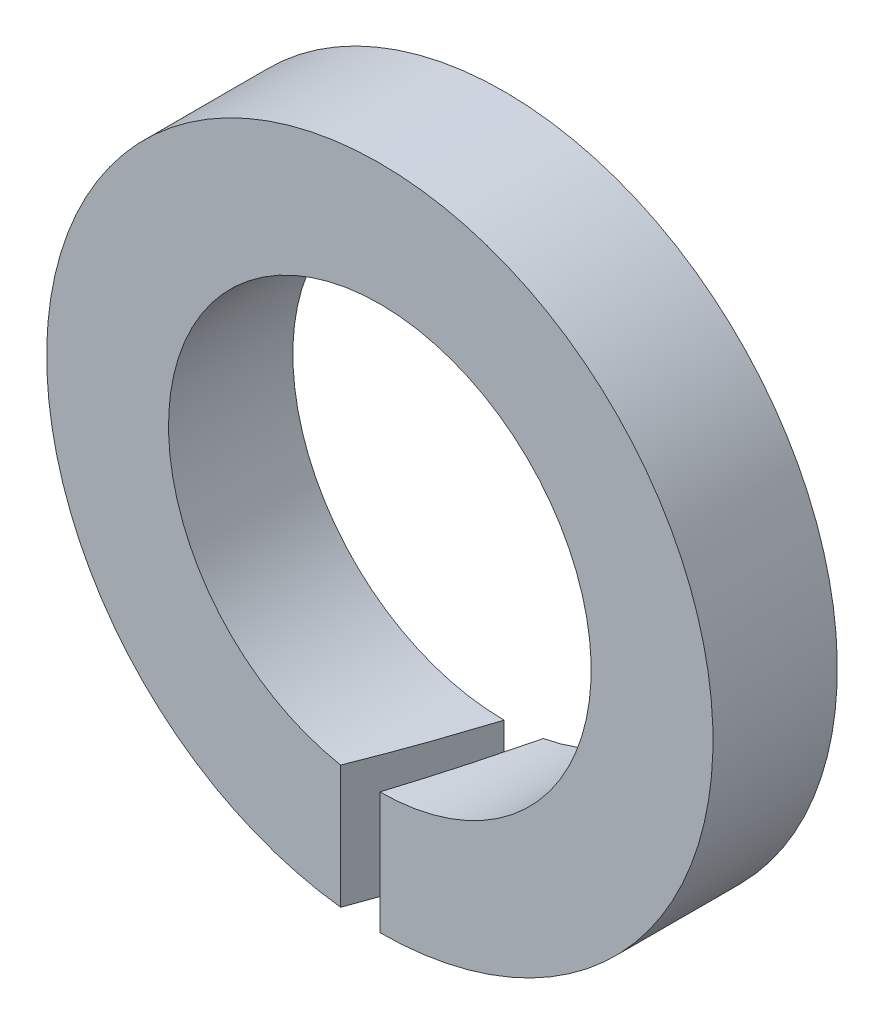
ISO-10303-21;
HEADER;
FILE_DESCRIPTION(('STEP AP214'),'2;1');
FILE_NAME('part.step','',(''),(''),'','','');
FILE_SCHEMA(('AUTOMOTIVE_DESIGN { 1 0 10303 214 1 1 1 1 }'));
ENDSEC;
DATA;
#1=APPLICATION_CONTEXT('core data for automotive mechanical design processes');
#2=APPLICATION_PROTOCOL_DEFINITION('international standard','automotive_design',2000,#1);
#3=PRODUCT_CONTEXT('',#1,'mechanical');
#4=PRODUCT('Part','Part','',(#3));
#5=PRODUCT_RELATED_PRODUCT_CATEGORY('part','',(#4));
#6=PRODUCT_DEFINITION_FORMATION('','',#4);
#7=PRODUCT_DEFINITION_CONTEXT('part definition',#1,'design');
#8=PRODUCT_DEFINITION('design','',#6,#7);
#9=PRODUCT_DEFINITION_SHAPE('','',#8);
#10=(LENGTH_UNIT() NAMED_UNIT(*) SI_UNIT(.MILLI.,.METRE.));
#11=(NAMED_UNIT(*) PLANE_ANGLE_UNIT() SI_UNIT($,.RADIAN.));
#12=(NAMED_UNIT(*) SI_UNIT($,.STERADIAN.) SOLID_ANGLE_UNIT());
#13=UNCERTAINTY_MEASURE_WITH_UNIT(LENGTH_MEASURE(1.E-05),#10,'distance_accuracy_value','');
#14=(GEOMETRIC_REPRESENTATION_CONTEXT(3) GLOBAL_UNCERTAINTY_ASSIGNED_CONTEXT((#13)) GLOBAL_UNIT_ASSIGNED_CONTEXT((#10,
#11,#12)) REPRESENTATION_CONTEXT('',''));
#15=CARTESIAN_POINT('',(0.,0.,0.));
#16=DIRECTION('',(0.,0.,1.));
#17=DIRECTION('',(1.,0.,0.));
#18=AXIS2_PLACEMENT_3D('',#15,#16,#17);
#19=CARTESIAN_POINT('',(0.,0.,0.));
#20=DIRECTION('',(0.,0.,-1.));
#21=DIRECTION('',(0.,1.,0.));
#22=AXIS2_PLACEMENT_3D('',#19,#20,#21);
#23=CYLINDRICAL_SURFACE('',#22,4.25);
#24=CARTESIAN_POINT('',(-1.11022302462516E-13,0.,2.5));
#25=DIRECTION('',(0.,0.,-1.));
#26=DIRECTION('',(0.,1.,0.));
#27=AXIS2_PLACEMENT_3D('',#24,#25,#26);
#28=CIRCLE('',#27,4.25);
#29=CARTESIAN_POINT('',(-0.788235294117812,-4.17626449367221,2.50000000000002));
#30=VERTEX_POINT('',#29);
#31=CARTESIAN_POINT('',(-1.80411241501588E-13,-4.24999999999998,2.50000000000003));
#32=VERTEX_POINT('',#31);
#33=EDGE_CURVE('E11',#30,#32,#28,.T.);
#34=ORIENTED_EDGE('',*,*,#33,.F.);
#35=CARTESIAN_POINT('',(0.,0.,0.));
#36=DIRECTION('',(-0.953718228392325,0.,-0.300701747304875));
#37=DIRECTION('',(0.300701747304875,0.,-0.953718228392325));
#38=AXIS2_PLACEMENT_3D('',#35,#36,#37);
#39=ELLIPSE('',#38,14.1336059337594,4.25);
#40=CARTESIAN_POINT('',(0.,-4.24999999999996,0.));
#41=VERTEX_POINT('',#40);
#42=EDGE_CURVE('E78',#30,#41,#39,.F.);
#43=ORIENTED_EDGE('',*,*,#42,.T.);
#44=CARTESIAN_POINT('',(0.,0.,0.));
#45=DIRECTION('',(0.,0.,-1.));
#46=DIRECTION('',(0.,1.,0.));
#47=AXIS2_PLACEMENT_3D('',#44,#45,#46);
#48=CIRCLE('',#47,4.25);
#49=CARTESIAN_POINT('',(0.78823529411759,-4.17626449367219,0.));
#50=VERTEX_POINT('',#49);
#51=EDGE_CURVE('E73',#41,#50,#48,.T.);
#52=ORIENTED_EDGE('',*,*,#51,.T.);
#53=CARTESIAN_POINT('',(-1.11022302462516E-13,0.,2.5));
#54=DIRECTION('',(-0.953718228392325,0.,-0.300701747304875));
#55=DIRECTION('',(0.300701747304875,0.,-0.953718228392325));
#56=AXIS2_PLACEMENT_3D('',#53,#54,#55);
#57=ELLIPSE('',#56,14.1336059337594,4.25);
#58=EDGE_CURVE('E30',#32,#50,#57,.F.);
#59=ORIENTED_EDGE('',*,*,#58,.F.);
#60=EDGE_LOOP('',(#34,#43,#52,#59));
#61=FACE_BOUND('',#60,.T.);
#62=ADVANCED_FACE('F16',(#61),#23,.F.);
#63=CARTESIAN_POINT('',(6.69999999999991,0.,2.50000000000003));
#64=DIRECTION('',(0.,0.,1.));
#65=DIRECTION('',(0.,-1.,0.));
#66=AXIS2_PLACEMENT_3D('',#63,#64,#65);
#67=PLANE('',#66);
#68=DIRECTION('',(0.,1.,0.));
#69=VECTOR('',#68,1.);
#70=CARTESIAN_POINT('',(-0.788235294117756,-6.94499999999999,2.50000000000003));
#71=LINE('',#70,#69);
#72=CARTESIAN_POINT('',(-0.788235294117826,-6.65347165929991,2.50000000000003));
#73=VERTEX_POINT('',#72);
#74=EDGE_CURVE('E63',#73,#30,#71,.T.);
#75=ORIENTED_EDGE('',*,*,#74,.T.);
#76=ORIENTED_EDGE('',*,*,#33,.T.);
#77=DIRECTION('',(0.,1.,0.));
#78=VECTOR('',#77,1.);
#79=CARTESIAN_POINT('',(-1.11022302462516E-13,-6.94499999999999,2.50000000000003));
#80=LINE('',#79,#78);
#81=CARTESIAN_POINT('',(-1.80411241501588E-13,-6.69999999999998,2.50000000000003));
#82=VERTEX_POINT('',#81);
#83=EDGE_CURVE('E57',#82,#32,#80,.T.);
#84=ORIENTED_EDGE('',*,*,#83,.F.);
#85=CARTESIAN_POINT('',(-1.11022302462516E-13,0.,2.5));
#86=DIRECTION('',(0.,0.,-1.));
#87=DIRECTION('',(0.,1.,0.));
#88=AXIS2_PLACEMENT_3D('',#85,#86,#87);
#89=CIRCLE('',#88,6.7);
#90=EDGE_CURVE('E23',#73,#82,#89,.T.);
#91=ORIENTED_EDGE('',*,*,#90,.F.);
#92=EDGE_LOOP('',(#75,#76,#84,#91));
#93=FACE_BOUND('',#92,.T.);
#94=ADVANCED_FACE('F68',(#93),#67,.T.);
#95=CARTESIAN_POINT('',(0.,0.,0.));
#96=DIRECTION('',(0.,0.,-1.));
#97=DIRECTION('',(0.,1.,0.));
#98=AXIS2_PLACEMENT_3D('',#95,#96,#97);
#99=CYLINDRICAL_SURFACE('',#98,6.7);
#100=CARTESIAN_POINT('',(0.,0.,0.));
#101=DIRECTION('',(-0.953718228392325,0.,-0.300701747304875));
#102=DIRECTION('',(0.300701747304875,0.,-0.953718228392325));
#103=AXIS2_PLACEMENT_3D('',#100,#101,#102);
#104=ELLIPSE('',#103,22.2812140602795,6.7);
#105=CARTESIAN_POINT('',(0.,-6.69999999999996,0.));
#106=VERTEX_POINT('',#105);
#107=EDGE_CURVE('E38',#73,#106,#104,.F.);
#108=ORIENTED_EDGE('',*,*,#107,.F.);
#109=ORIENTED_EDGE('',*,*,#90,.T.);
#110=CARTESIAN_POINT('',(-1.11022302462516E-13,0.,2.5));
#111=DIRECTION('',(-0.953718228392325,0.,-0.300701747304875));
#112=DIRECTION('',(0.300701747304875,0.,-0.953718228392325));
#113=AXIS2_PLACEMENT_3D('',#110,#111,#112);
#114=ELLIPSE('',#113,22.2812140602795,6.7);
#115=CARTESIAN_POINT('',(0.788235294117576,-6.65347165929989,0.));
#116=VERTEX_POINT('',#115);
#117=EDGE_CURVE('E54',#82,#116,#114,.F.);
#118=ORIENTED_EDGE('',*,*,#117,.T.);
#119=CARTESIAN_POINT('',(0.,0.,0.));
#120=DIRECTION('',(0.,0.,-1.));
#121=DIRECTION('',(0.,1.,0.));
#122=AXIS2_PLACEMENT_3D('',#119,#120,#121);
#123=CIRCLE('',#122,6.7);
#124=EDGE_CURVE('E72',#106,#116,#123,.T.);
#125=ORIENTED_EDGE('',*,*,#124,.F.);
#126=EDGE_LOOP('',(#108,#109,#118,#125));
#127=FACE_BOUND('',#126,.T.);
#128=ADVANCED_FACE('F71',(#127),#99,.T.);
#129=CARTESIAN_POINT('',(4.24999999999991,0.,0.));
#130=DIRECTION('',(0.,0.,-1.));
#131=DIRECTION('',(0.,1.,0.));
#132=AXIS2_PLACEMENT_3D('',#129,#130,#131);
#133=PLANE('',#132);
#134=DIRECTION('',(0.,1.,0.));
#135=VECTOR('',#134,1.);
#136=CARTESIAN_POINT('',(0.,-6.94499999999996,0.));
#137=LINE('',#136,#135);
#138=EDGE_CURVE('E83',#106,#41,#137,.T.);
#139=ORIENTED_EDGE('',*,*,#138,.F.);
#140=ORIENTED_EDGE('',*,*,#124,.T.);
#141=DIRECTION('',(0.,1.,0.));
#142=VECTOR('',#141,1.);
#143=CARTESIAN_POINT('',(0.788235294117645,-6.94499999999996,0.));
#144=LINE('',#143,#142);
#145=EDGE_CURVE('E58',#116,#50,#144,.T.);
#146=ORIENTED_EDGE('',*,*,#145,.T.);
#147=ORIENTED_EDGE('',*,*,#51,.F.);
#148=EDGE_LOOP('',(#139,#140,#146,#147));
#149=FACE_BOUND('',#148,.T.);
#150=ADVANCED_FACE('F89',(#149),#133,.T.);
#151=CARTESIAN_POINT('',(0.788235294117645,-6.94499999999996,0.));
#152=DIRECTION('',(-0.953718228392325,0.,-0.300701747304875));
#153=DIRECTION('',(0.300701747304875,0.,-0.953718228392325));
#154=AXIS2_PLACEMENT_3D('',#151,#152,#153);
#155=PLANE('',#154);
#156=ORIENTED_EDGE('',*,*,#58,.T.);
#157=ORIENTED_EDGE('',*,*,#145,.F.);
#158=ORIENTED_EDGE('',*,*,#117,.F.);
#159=ORIENTED_EDGE('',*,*,#83,.T.);
#160=EDGE_LOOP('',(#156,#157,#158,#159));
#161=FACE_BOUND('',#160,.T.);
#162=ADVANCED_FACE('F56',(#161),#155,.T.);
#163=CARTESIAN_POINT('',(0.,-6.94499999999996,0.));
#164=DIRECTION('',(-0.953718228392325,0.,-0.300701747304875));
#165=DIRECTION('',(0.300701747304875,0.,-0.953718228392325));
#166=AXIS2_PLACEMENT_3D('',#163,#164,#165);
#167=PLANE('',#166);
#168=ORIENTED_EDGE('',*,*,#74,.F.);
#169=ORIENTED_EDGE('',*,*,#107,.T.);
#170=ORIENTED_EDGE('',*,*,#138,.T.);
#171=ORIENTED_EDGE('',*,*,#42,.F.);
#172=EDGE_LOOP('',(#168,#169,#170,#171));
#173=FACE_BOUND('',#172,.T.);
#174=ADVANCED_FACE('F90',(#173),#167,.F.);
#175=CLOSED_SHELL('',(#62,#94,#128,#150,#162,#174));
#176=MANIFOLD_SOLID_BREP('B1',#175);
#177=ADVANCED_BREP_SHAPE_REPRESENTATION('',(#18,#176),#14);
#178=SHAPE_DEFINITION_REPRESENTATION(#9,#177);
ENDSEC;
END-ISO-10303-21;
